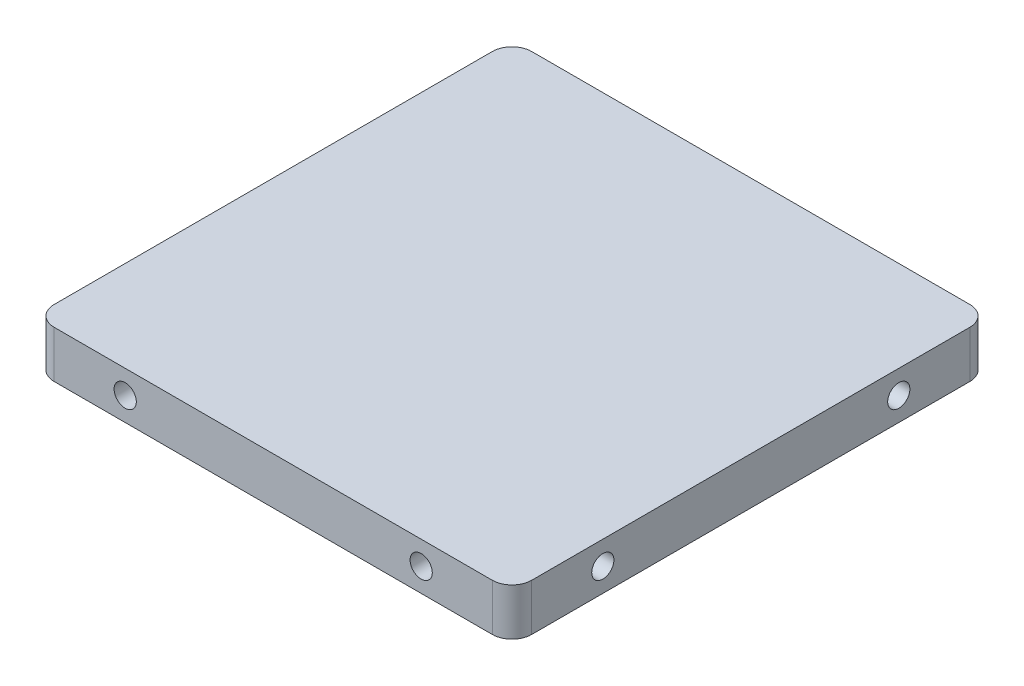
ISO-10303-21;
HEADER;
FILE_DESCRIPTION(('STEP AP214'),'2;1');
FILE_NAME('part.step','',(''),(''),'','','');
FILE_SCHEMA(('AUTOMOTIVE_DESIGN { 1 0 10303 214 1 1 1 1 }'));
ENDSEC;
DATA;
#1=APPLICATION_CONTEXT('core data for automotive mechanical design processes');
#2=APPLICATION_PROTOCOL_DEFINITION('international standard','automotive_design',2000,#1);
#3=PRODUCT_CONTEXT('',#1,'mechanical');
#4=PRODUCT('Part','Part','',(#3));
#5=PRODUCT_RELATED_PRODUCT_CATEGORY('part','',(#4));
#6=PRODUCT_DEFINITION_FORMATION('','',#4);
#7=PRODUCT_DEFINITION_CONTEXT('part definition',#1,'design');
#8=PRODUCT_DEFINITION('design','',#6,#7);
#9=PRODUCT_DEFINITION_SHAPE('','',#8);
#10=(LENGTH_UNIT() NAMED_UNIT(*) SI_UNIT(.MILLI.,.METRE.));
#11=(NAMED_UNIT(*) PLANE_ANGLE_UNIT() SI_UNIT($,.RADIAN.));
#12=(NAMED_UNIT(*) SI_UNIT($,.STERADIAN.) SOLID_ANGLE_UNIT());
#13=UNCERTAINTY_MEASURE_WITH_UNIT(LENGTH_MEASURE(1.E-05),#10,'distance_accuracy_value','');
#14=(GEOMETRIC_REPRESENTATION_CONTEXT(3) GLOBAL_UNCERTAINTY_ASSIGNED_CONTEXT((#13)) GLOBAL_UNIT_ASSIGNED_CONTEXT((#10,
#11,#12)) REPRESENTATION_CONTEXT('',''));
#15=CARTESIAN_POINT('',(0.,0.,0.));
#16=DIRECTION('',(0.,0.,1.));
#17=DIRECTION('',(1.,0.,0.));
#18=AXIS2_PLACEMENT_3D('',#15,#16,#17);
#19=CARTESIAN_POINT('',(-48.4125,0.,-30.));
#20=DIRECTION('',(-1.,0.,0.));
#21=DIRECTION('',(0.,0.,1.));
#22=AXIS2_PLACEMENT_3D('',#19,#20,#21);
#23=CYLINDRICAL_SURFACE('',#22,2.24999999999998);
#24=CARTESIAN_POINT('',(-30.,0.,-30.));
#25=DIRECTION('',(-0.707106781186547,0.,0.707106781186547));
#26=DIRECTION('',(-0.707106781186547,0.,-0.707106781186547));
#27=AXIS2_PLACEMENT_3D('',#24,#25,#26);
#28=ELLIPSE('',#27,3.18198051533944,2.24999999999998);
#29=CARTESIAN_POINT('',(-30.,-2.24999999999998,-30.));
#30=VERTEX_POINT('',#29);
#31=CARTESIAN_POINT('',(-30.,2.24999999999998,-30.));
#32=VERTEX_POINT('',#31);
#33=EDGE_CURVE('E160',#30,#32,#28,.T.);
#34=ORIENTED_EDGE('',*,*,#33,.T.);
#35=CARTESIAN_POINT('',(-30.,0.,-30.));
#36=DIRECTION('',(-0.707106781186547,0.,-0.707106781186547));
#37=DIRECTION('',(-0.707106781186547,0.,0.707106781186547));
#38=AXIS2_PLACEMENT_3D('',#35,#36,#37);
#39=ELLIPSE('',#38,3.18198051533944,2.24999999999998);
#40=EDGE_CURVE('E156',#32,#30,#39,.T.);
#41=ORIENTED_EDGE('',*,*,#40,.T.);
#42=EDGE_LOOP('',(#34,#41));
#43=FACE_BOUND('',#42,.T.);
#44=CARTESIAN_POINT('',(30.,0.,-30.));
#45=DIRECTION('',(-0.707106781186547,0.,0.707106781186547));
#46=DIRECTION('',(-0.707106781186547,0.,-0.707106781186547));
#47=AXIS2_PLACEMENT_3D('',#44,#45,#46);
#48=ELLIPSE('',#47,3.18198051533944,2.24999999999998);
#49=CARTESIAN_POINT('',(30.,-2.24999999999998,-30.));
#50=VERTEX_POINT('',#49);
#51=CARTESIAN_POINT('',(30.,2.24999999999998,-30.));
#52=VERTEX_POINT('',#51);
#53=EDGE_CURVE('E60',#50,#52,#48,.F.);
#54=ORIENTED_EDGE('',*,*,#53,.T.);
#55=CARTESIAN_POINT('',(30.,0.,-30.));
#56=DIRECTION('',(-0.707106781186547,0.,-0.707106781186547));
#57=DIRECTION('',(-0.707106781186547,0.,0.707106781186547));
#58=AXIS2_PLACEMENT_3D('',#55,#56,#57);
#59=ELLIPSE('',#58,3.18198051533944,2.24999999999998);
#60=EDGE_CURVE('E290',#52,#50,#59,.F.);
#61=ORIENTED_EDGE('',*,*,#60,.T.);
#62=EDGE_LOOP('',(#54,#61));
#63=FACE_BOUND('',#62,.T.);
#64=ADVANCED_FACE('F45',(#43,#63),#23,.F.);
#65=CARTESIAN_POINT('',(-48.4125,0.,30.));
#66=DIRECTION('',(-1.,0.,0.));
#67=DIRECTION('',(0.,0.,1.));
#68=AXIS2_PLACEMENT_3D('',#65,#66,#67);
#69=CYLINDRICAL_SURFACE('',#68,2.24999999999998);
#70=CARTESIAN_POINT('',(-30.,0.,30.));
#71=DIRECTION('',(-0.707106781186547,0.,0.707106781186547));
#72=DIRECTION('',(-0.707106781186547,0.,-0.707106781186547));
#73=AXIS2_PLACEMENT_3D('',#70,#71,#72);
#74=ELLIPSE('',#73,3.18198051533944,2.24999999999998);
#75=CARTESIAN_POINT('',(-30.,-2.24999999999998,30.));
#76=VERTEX_POINT('',#75);
#77=CARTESIAN_POINT('',(-30.,2.24999999999998,30.));
#78=VERTEX_POINT('',#77);
#79=EDGE_CURVE('E275',#76,#78,#74,.T.);
#80=ORIENTED_EDGE('',*,*,#79,.T.);
#81=CARTESIAN_POINT('',(-30.,0.,30.));
#82=DIRECTION('',(-0.707106781186547,0.,-0.707106781186547));
#83=DIRECTION('',(-0.707106781186547,0.,0.707106781186547));
#84=AXIS2_PLACEMENT_3D('',#81,#82,#83);
#85=ELLIPSE('',#84,3.18198051533944,2.24999999999998);
#86=EDGE_CURVE('E271',#78,#76,#85,.T.);
#87=ORIENTED_EDGE('',*,*,#86,.T.);
#88=EDGE_LOOP('',(#80,#87));
#89=FACE_BOUND('',#88,.T.);
#90=CARTESIAN_POINT('',(30.,0.,30.));
#91=DIRECTION('',(-0.707106781186547,0.,0.707106781186547));
#92=DIRECTION('',(-0.707106781186547,0.,-0.707106781186547));
#93=AXIS2_PLACEMENT_3D('',#90,#91,#92);
#94=ELLIPSE('',#93,3.18198051533944,2.24999999999998);
#95=CARTESIAN_POINT('',(30.,-2.24999999999998,30.));
#96=VERTEX_POINT('',#95);
#97=CARTESIAN_POINT('',(30.,2.24999999999998,30.));
#98=VERTEX_POINT('',#97);
#99=EDGE_CURVE('E66',#96,#98,#94,.F.);
#100=ORIENTED_EDGE('',*,*,#99,.T.);
#101=CARTESIAN_POINT('',(30.,0.,30.));
#102=DIRECTION('',(-0.707106781186547,0.,-0.707106781186547));
#103=DIRECTION('',(-0.707106781186547,0.,0.707106781186547));
#104=AXIS2_PLACEMENT_3D('',#101,#102,#103);
#105=ELLIPSE('',#104,3.18198051533944,2.24999999999998);
#106=EDGE_CURVE('E11',#98,#96,#105,.F.);
#107=ORIENTED_EDGE('',*,*,#106,.T.);
#108=EDGE_LOOP('',(#100,#107));
#109=FACE_BOUND('',#108,.T.);
#110=ADVANCED_FACE('F148',(#89,#109),#69,.F.);
#111=CARTESIAN_POINT('',(-48.4125,0.,30.));
#112=DIRECTION('',(-1.,0.,0.));
#113=DIRECTION('',(0.,0.,1.));
#114=AXIS2_PLACEMENT_3D('',#111,#112,#113);
#115=CIRCLE('',#114,2.24999999999999);
#116=CARTESIAN_POINT('',(-48.4125,0.,32.25));
#117=VERTEX_POINT('',#116);
#118=EDGE_CURVE('E255',#117,#117,#115,.T.);
#119=ORIENTED_EDGE('',*,*,#118,.T.);
#120=EDGE_LOOP('',(#119));
#121=FACE_BOUND('',#120,.T.);
#122=CARTESIAN_POINT('',(-30.,0.,30.));
#123=DIRECTION('',(-0.707106781186547,0.,0.707106781186547));
#124=DIRECTION('',(-0.707106781186547,0.,-0.707106781186547));
#125=AXIS2_PLACEMENT_3D('',#122,#123,#124);
#126=ELLIPSE('',#125,3.18198051533944,2.24999999999998);
#127=EDGE_CURVE('E279',#76,#78,#126,.F.);
#128=ORIENTED_EDGE('',*,*,#127,.T.);
#129=CARTESIAN_POINT('',(-30.,0.,30.));
#130=DIRECTION('',(-0.707106781186547,0.,-0.707106781186547));
#131=DIRECTION('',(-0.707106781186547,0.,0.707106781186547));
#132=AXIS2_PLACEMENT_3D('',#129,#130,#131);
#133=ELLIPSE('',#132,3.18198051533944,2.24999999999998);
#134=EDGE_CURVE('E267',#78,#76,#133,.F.);
#135=ORIENTED_EDGE('',*,*,#134,.T.);
#136=EDGE_LOOP('',(#128,#135));
#137=FACE_BOUND('',#136,.T.);
#138=ADVANCED_FACE('F375',(#121,#137),#69,.F.);
#139=CARTESIAN_POINT('',(-48.4125,0.,-30.));
#140=DIRECTION('',(-1.,0.,0.));
#141=DIRECTION('',(0.,0.,1.));
#142=AXIS2_PLACEMENT_3D('',#139,#140,#141);
#143=CIRCLE('',#142,2.24999999999999);
#144=CARTESIAN_POINT('',(-48.4125,0.,-27.75));
#145=VERTEX_POINT('',#144);
#146=EDGE_CURVE('E263',#145,#145,#143,.T.);
#147=ORIENTED_EDGE('',*,*,#146,.T.);
#148=EDGE_LOOP('',(#147));
#149=FACE_BOUND('',#148,.T.);
#150=CARTESIAN_POINT('',(-30.,0.,-30.));
#151=DIRECTION('',(-0.707106781186547,0.,0.707106781186547));
#152=DIRECTION('',(-0.707106781186547,0.,-0.707106781186547));
#153=AXIS2_PLACEMENT_3D('',#150,#151,#152);
#154=ELLIPSE('',#153,3.18198051533944,2.24999999999998);
#155=EDGE_CURVE('E164',#30,#32,#154,.F.);
#156=ORIENTED_EDGE('',*,*,#155,.T.);
#157=CARTESIAN_POINT('',(-30.,0.,-30.));
#158=DIRECTION('',(-0.707106781186547,0.,-0.707106781186547));
#159=DIRECTION('',(-0.707106781186547,0.,0.707106781186547));
#160=AXIS2_PLACEMENT_3D('',#157,#158,#159);
#161=ELLIPSE('',#160,3.18198051533944,2.24999999999998);
#162=EDGE_CURVE('E146',#32,#30,#161,.F.);
#163=ORIENTED_EDGE('',*,*,#162,.T.);
#164=EDGE_LOOP('',(#156,#163));
#165=FACE_BOUND('',#164,.T.);
#166=ADVANCED_FACE('F369',(#149,#165),#23,.F.);
#167=CARTESIAN_POINT('',(-48.4125,4.7625,48.4125));
#168=DIRECTION('',(1.,0.,0.));
#169=DIRECTION('',(0.,0.,-1.));
#170=AXIS2_PLACEMENT_3D('',#167,#168,#169);
#171=PLANE('',#170);
#172=ORIENTED_EDGE('',*,*,#146,.F.);
#173=EDGE_LOOP('',(#172));
#174=FACE_BOUND('',#173,.T.);
#175=ORIENTED_EDGE('',*,*,#118,.F.);
#176=EDGE_LOOP('',(#175));
#177=FACE_BOUND('',#176,.T.);
#178=DIRECTION('',(0.,0.,1.));
#179=VECTOR('',#178,1.);
#180=CARTESIAN_POINT('',(-48.4125,4.7625,48.4125));
#181=LINE('',#180,#179);
#182=CARTESIAN_POINT('',(-48.4125,4.7625,-44.4125));
#183=VERTEX_POINT('',#182);
#184=CARTESIAN_POINT('',(-48.4125,4.7625,44.4125));
#185=VERTEX_POINT('',#184);
#186=EDGE_CURVE('E224',#183,#185,#181,.T.);
#187=ORIENTED_EDGE('',*,*,#186,.F.);
#188=DIRECTION('',(0.,-1.,0.));
#189=VECTOR('',#188,1.);
#190=CARTESIAN_POINT('',(-48.4125,4.7625,-44.4125));
#191=LINE('',#190,#189);
#192=CARTESIAN_POINT('',(-48.4125,-4.7625,-44.4125));
#193=VERTEX_POINT('',#192);
#194=EDGE_CURVE('E212',#183,#193,#191,.T.);
#195=ORIENTED_EDGE('',*,*,#194,.T.);
#196=DIRECTION('',(0.,0.,1.));
#197=VECTOR('',#196,1.);
#198=CARTESIAN_POINT('',(-48.4125,-4.7625,48.4125));
#199=LINE('',#198,#197);
#200=CARTESIAN_POINT('',(-48.4125,-4.7625,44.4125));
#201=VERTEX_POINT('',#200);
#202=EDGE_CURVE('E233',#193,#201,#199,.T.);
#203=ORIENTED_EDGE('',*,*,#202,.T.);
#204=DIRECTION('',(0.,-1.,0.));
#205=VECTOR('',#204,1.);
#206=CARTESIAN_POINT('',(-48.4125,4.7625,44.4125));
#207=LINE('',#206,#205);
#208=EDGE_CURVE('E216',#201,#185,#207,.F.);
#209=ORIENTED_EDGE('',*,*,#208,.T.);
#210=EDGE_LOOP('',(#187,#195,#203,#209));
#211=FACE_BOUND('',#210,.T.);
#212=ADVANCED_FACE('F336',(#174,#177,#211),#171,.F.);
#213=CARTESIAN_POINT('',(48.4125,4.7625,48.4125));
#214=DIRECTION('',(0.,0.,-1.));
#215=DIRECTION('',(-1.,0.,0.));
#216=AXIS2_PLACEMENT_3D('',#213,#214,#215);
#217=PLANE('',#216);
#218=CARTESIAN_POINT('',(30.,0.,48.4125));
#219=DIRECTION('',(0.,0.,-1.));
#220=DIRECTION('',(-1.,0.,0.));
#221=AXIS2_PLACEMENT_3D('',#218,#219,#220);
#222=CIRCLE('',#221,2.24999999999997);
#223=CARTESIAN_POINT('',(27.75,0.,48.4125));
#224=VERTEX_POINT('',#223);
#225=EDGE_CURVE('E303',#224,#224,#222,.T.);
#226=ORIENTED_EDGE('',*,*,#225,.T.);
#227=EDGE_LOOP('',(#226));
#228=FACE_BOUND('',#227,.T.);
#229=CARTESIAN_POINT('',(-30.,0.,48.4125));
#230=DIRECTION('',(0.,0.,-1.));
#231=DIRECTION('',(-1.,0.,0.));
#232=AXIS2_PLACEMENT_3D('',#229,#230,#231);
#233=CIRCLE('',#232,2.24999999999997);
#234=CARTESIAN_POINT('',(-32.25,0.,48.4125));
#235=VERTEX_POINT('',#234);
#236=EDGE_CURVE('E282',#235,#235,#233,.T.);
#237=ORIENTED_EDGE('',*,*,#236,.T.);
#238=EDGE_LOOP('',(#237));
#239=FACE_BOUND('',#238,.T.);
#240=DIRECTION('',(1.,0.,0.));
#241=VECTOR('',#240,1.);
#242=CARTESIAN_POINT('',(48.4125,-4.7625,48.4125));
#243=LINE('',#242,#241);
#244=CARTESIAN_POINT('',(-44.4125,-4.7625,48.4125));
#245=VERTEX_POINT('',#244);
#246=CARTESIAN_POINT('',(44.4125,-4.7625,48.4125));
#247=VERTEX_POINT('',#246);
#248=EDGE_CURVE('E229',#245,#247,#243,.T.);
#249=ORIENTED_EDGE('',*,*,#248,.T.);
#250=DIRECTION('',(0.,-1.,0.));
#251=VECTOR('',#250,1.);
#252=CARTESIAN_POINT('',(44.4125,4.7625,48.4125));
#253=LINE('',#252,#251);
#254=CARTESIAN_POINT('',(44.4125,4.7625,48.4125));
#255=VERTEX_POINT('',#254);
#256=EDGE_CURVE('E167',#247,#255,#253,.F.);
#257=ORIENTED_EDGE('',*,*,#256,.T.);
#258=DIRECTION('',(1.,0.,0.));
#259=VECTOR('',#258,1.);
#260=CARTESIAN_POINT('',(48.4125,4.7625,48.4125));
#261=LINE('',#260,#259);
#262=CARTESIAN_POINT('',(-44.4125,4.7625,48.4125));
#263=VERTEX_POINT('',#262);
#264=EDGE_CURVE('E245',#263,#255,#261,.T.);
#265=ORIENTED_EDGE('',*,*,#264,.F.);
#266=DIRECTION('',(0.,-1.,0.));
#267=VECTOR('',#266,1.);
#268=CARTESIAN_POINT('',(-44.4125,4.7625,48.4125));
#269=LINE('',#268,#267);
#270=EDGE_CURVE('E170',#263,#245,#269,.T.);
#271=ORIENTED_EDGE('',*,*,#270,.T.);
#272=EDGE_LOOP('',(#249,#257,#265,#271));
#273=FACE_BOUND('',#272,.T.);
#274=ADVANCED_FACE('F344',(#228,#239,#273),#217,.F.);
#275=CARTESIAN_POINT('',(48.4125,4.7625,48.4125));
#276=DIRECTION('',(-1.,0.,0.));
#277=DIRECTION('',(0.,0.,1.));
#278=AXIS2_PLACEMENT_3D('',#275,#276,#277);
#279=PLANE('',#278);
#280=CARTESIAN_POINT('',(48.4125,0.,-30.));
#281=DIRECTION('',(-1.,0.,0.));
#282=DIRECTION('',(0.,0.,1.));
#283=AXIS2_PLACEMENT_3D('',#280,#281,#282);
#284=CIRCLE('',#283,2.24999999999998);
#285=CARTESIAN_POINT('',(48.4125,0.,-27.75));
#286=VERTEX_POINT('',#285);
#287=EDGE_CURVE('E259',#286,#286,#284,.T.);
#288=ORIENTED_EDGE('',*,*,#287,.T.);
#289=EDGE_LOOP('',(#288));
#290=FACE_BOUND('',#289,.T.);
#291=CARTESIAN_POINT('',(48.4125,0.,30.));
#292=DIRECTION('',(-1.,0.,0.));
#293=DIRECTION('',(0.,0.,1.));
#294=AXIS2_PLACEMENT_3D('',#291,#292,#293);
#295=CIRCLE('',#294,2.24999999999998);
#296=CARTESIAN_POINT('',(48.4125,0.,32.25));
#297=VERTEX_POINT('',#296);
#298=EDGE_CURVE('E237',#297,#297,#295,.T.);
#299=ORIENTED_EDGE('',*,*,#298,.T.);
#300=EDGE_LOOP('',(#299));
#301=FACE_BOUND('',#300,.T.);
#302=DIRECTION('',(0.,0.,-1.));
#303=VECTOR('',#302,1.);
#304=CARTESIAN_POINT('',(48.4125,-4.7625,48.4125));
#305=LINE('',#304,#303);
#306=CARTESIAN_POINT('',(48.4125,-4.7625,44.4125));
#307=VERTEX_POINT('',#306);
#308=CARTESIAN_POINT('',(48.4125,-4.7625,-44.4125));
#309=VERTEX_POINT('',#308);
#310=EDGE_CURVE('E225',#307,#309,#305,.T.);
#311=ORIENTED_EDGE('',*,*,#310,.T.);
#312=DIRECTION('',(0.,-1.,0.));
#313=VECTOR('',#312,1.);
#314=CARTESIAN_POINT('',(48.4125,4.7625,-44.4125));
#315=LINE('',#314,#313);
#316=CARTESIAN_POINT('',(48.4125,4.7625,-44.4125));
#317=VERTEX_POINT('',#316);
#318=EDGE_CURVE('E174',#309,#317,#315,.F.);
#319=ORIENTED_EDGE('',*,*,#318,.T.);
#320=DIRECTION('',(0.,0.,-1.));
#321=VECTOR('',#320,1.);
#322=CARTESIAN_POINT('',(48.4125,4.7625,48.4125));
#323=LINE('',#322,#321);
#324=CARTESIAN_POINT('',(48.4125,4.7625,44.4125));
#325=VERTEX_POINT('',#324);
#326=EDGE_CURVE('E241',#325,#317,#323,.T.);
#327=ORIENTED_EDGE('',*,*,#326,.F.);
#328=DIRECTION('',(0.,-1.,0.));
#329=VECTOR('',#328,1.);
#330=CARTESIAN_POINT('',(48.4125,4.7625,44.4125));
#331=LINE('',#330,#329);
#332=EDGE_CURVE('E177',#325,#307,#331,.T.);
#333=ORIENTED_EDGE('',*,*,#332,.T.);
#334=EDGE_LOOP('',(#311,#319,#327,#333));
#335=FACE_BOUND('',#334,.T.);
#336=ADVANCED_FACE('F319',(#290,#301,#335),#279,.F.);
#337=CARTESIAN_POINT('',(48.4125,4.7625,-48.4125));
#338=DIRECTION('',(0.,0.,1.));
#339=DIRECTION('',(1.,0.,0.));
#340=AXIS2_PLACEMENT_3D('',#337,#338,#339);
#341=PLANE('',#340);
#342=CARTESIAN_POINT('',(30.,0.,-48.4125));
#343=DIRECTION('',(0.,0.,-1.));
#344=DIRECTION('',(-1.,0.,0.));
#345=AXIS2_PLACEMENT_3D('',#342,#343,#344);
#346=CIRCLE('',#345,2.24999999999999);
#347=CARTESIAN_POINT('',(27.75,0.,-48.4125));
#348=VERTEX_POINT('',#347);
#349=EDGE_CURVE('E307',#348,#348,#346,.T.);
#350=ORIENTED_EDGE('',*,*,#349,.F.);
#351=EDGE_LOOP('',(#350));
#352=FACE_BOUND('',#351,.T.);
#353=CARTESIAN_POINT('',(-30.,0.,-48.4125));
#354=DIRECTION('',(0.,0.,-1.));
#355=DIRECTION('',(-1.,0.,0.));
#356=AXIS2_PLACEMENT_3D('',#353,#354,#355);
#357=CIRCLE('',#356,2.24999999999999);
#358=CARTESIAN_POINT('',(-32.25,0.,-48.4125));
#359=VERTEX_POINT('',#358);
#360=EDGE_CURVE('E286',#359,#359,#357,.T.);
#361=ORIENTED_EDGE('',*,*,#360,.F.);
#362=EDGE_LOOP('',(#361));
#363=FACE_BOUND('',#362,.T.);
#364=DIRECTION('',(-1.,0.,0.));
#365=VECTOR('',#364,1.);
#366=CARTESIAN_POINT('',(48.4125,-4.7625,-48.4125));
#367=LINE('',#366,#365);
#368=CARTESIAN_POINT('',(44.4125,-4.7625,-48.4125));
#369=VERTEX_POINT('',#368);
#370=CARTESIAN_POINT('',(-44.4125,-4.7625,-48.4125));
#371=VERTEX_POINT('',#370);
#372=EDGE_CURVE('E220',#369,#371,#367,.T.);
#373=ORIENTED_EDGE('',*,*,#372,.T.);
#374=DIRECTION('',(0.,-1.,0.));
#375=VECTOR('',#374,1.);
#376=CARTESIAN_POINT('',(-44.4125,4.7625,-48.4125));
#377=LINE('',#376,#375);
#378=CARTESIAN_POINT('',(-44.4125,4.7625,-48.4125));
#379=VERTEX_POINT('',#378);
#380=EDGE_CURVE('E193',#371,#379,#377,.F.);
#381=ORIENTED_EDGE('',*,*,#380,.T.);
#382=DIRECTION('',(-1.,0.,0.));
#383=VECTOR('',#382,1.);
#384=CARTESIAN_POINT('',(48.4125,4.7625,-48.4125));
#385=LINE('',#384,#383);
#386=CARTESIAN_POINT('',(44.4125,4.7625,-48.4125));
#387=VERTEX_POINT('',#386);
#388=EDGE_CURVE('E219',#387,#379,#385,.T.);
#389=ORIENTED_EDGE('',*,*,#388,.F.);
#390=DIRECTION('',(0.,-1.,0.));
#391=VECTOR('',#390,1.);
#392=CARTESIAN_POINT('',(44.4125,4.7625,-48.4125));
#393=LINE('',#392,#391);
#394=EDGE_CURVE('E196',#387,#369,#393,.T.);
#395=ORIENTED_EDGE('',*,*,#394,.T.);
#396=EDGE_LOOP('',(#373,#381,#389,#395));
#397=FACE_BOUND('',#396,.T.);
#398=ADVANCED_FACE('F315',(#352,#363,#397),#341,.F.);
#399=CARTESIAN_POINT('',(0.,4.7625,0.));
#400=DIRECTION('',(0.,1.,0.));
#401=DIRECTION('',(0.,0.,1.));
#402=AXIS2_PLACEMENT_3D('',#399,#400,#401);
#403=PLANE('',#402);
#404=ORIENTED_EDGE('',*,*,#388,.T.);
#405=CARTESIAN_POINT('',(-44.4125,4.7625,-44.4125));
#406=DIRECTION('',(0.,1.,0.));
#407=DIRECTION('',(0.,0.,1.));
#408=AXIS2_PLACEMENT_3D('',#405,#406,#407);
#409=CIRCLE('',#408,4.);
#410=EDGE_CURVE('E181',#379,#183,#409,.T.);
#411=ORIENTED_EDGE('',*,*,#410,.T.);
#412=ORIENTED_EDGE('',*,*,#186,.T.);
#413=CARTESIAN_POINT('',(-44.4125,4.7625,44.4125));
#414=DIRECTION('',(0.,1.,0.));
#415=DIRECTION('',(0.,0.,1.));
#416=AXIS2_PLACEMENT_3D('',#413,#414,#415);
#417=CIRCLE('',#416,4.);
#418=EDGE_CURVE('E190',#185,#263,#417,.T.);
#419=ORIENTED_EDGE('',*,*,#418,.T.);
#420=ORIENTED_EDGE('',*,*,#264,.T.);
#421=CARTESIAN_POINT('',(44.4125,4.7625,44.4125));
#422=DIRECTION('',(0.,1.,0.));
#423=DIRECTION('',(0.,0.,1.));
#424=AXIS2_PLACEMENT_3D('',#421,#422,#423);
#425=CIRCLE('',#424,4.);
#426=EDGE_CURVE('E187',#255,#325,#425,.T.);
#427=ORIENTED_EDGE('',*,*,#426,.T.);
#428=ORIENTED_EDGE('',*,*,#326,.T.);
#429=CARTESIAN_POINT('',(44.4125,4.7625,-44.4125));
#430=DIRECTION('',(0.,1.,0.));
#431=DIRECTION('',(0.,0.,1.));
#432=AXIS2_PLACEMENT_3D('',#429,#430,#431);
#433=CIRCLE('',#432,4.);
#434=EDGE_CURVE('E184',#317,#387,#433,.T.);
#435=ORIENTED_EDGE('',*,*,#434,.T.);
#436=EDGE_LOOP('',(#404,#411,#412,#419,#420,#427,#428,#435));
#437=FACE_BOUND('',#436,.T.);
#438=ADVANCED_FACE('F318',(#437),#403,.T.);
#439=CARTESIAN_POINT('',(0.,-4.7625,0.));
#440=DIRECTION('',(0.,1.,0.));
#441=DIRECTION('',(0.,0.,1.));
#442=AXIS2_PLACEMENT_3D('',#439,#440,#441);
#443=PLANE('',#442);
#444=ORIENTED_EDGE('',*,*,#202,.F.);
#445=CARTESIAN_POINT('',(-44.4125,-4.7625,-44.4125));
#446=DIRECTION('',(0.,1.,0.));
#447=DIRECTION('',(0.,0.,1.));
#448=AXIS2_PLACEMENT_3D('',#445,#446,#447);
#449=CIRCLE('',#448,4.);
#450=EDGE_CURVE('E200',#193,#371,#449,.F.);
#451=ORIENTED_EDGE('',*,*,#450,.T.);
#452=ORIENTED_EDGE('',*,*,#372,.F.);
#453=CARTESIAN_POINT('',(44.4125,-4.7625,-44.4125));
#454=DIRECTION('',(0.,1.,0.));
#455=DIRECTION('',(0.,0.,1.));
#456=AXIS2_PLACEMENT_3D('',#453,#454,#455);
#457=CIRCLE('',#456,4.);
#458=EDGE_CURVE('E203',#369,#309,#457,.F.);
#459=ORIENTED_EDGE('',*,*,#458,.T.);
#460=ORIENTED_EDGE('',*,*,#310,.F.);
#461=CARTESIAN_POINT('',(44.4125,-4.7625,44.4125));
#462=DIRECTION('',(0.,1.,0.));
#463=DIRECTION('',(0.,0.,1.));
#464=AXIS2_PLACEMENT_3D('',#461,#462,#463);
#465=CIRCLE('',#464,4.);
#466=EDGE_CURVE('E206',#307,#247,#465,.F.);
#467=ORIENTED_EDGE('',*,*,#466,.T.);
#468=ORIENTED_EDGE('',*,*,#248,.F.);
#469=CARTESIAN_POINT('',(-44.4125,-4.7625,44.4125));
#470=DIRECTION('',(0.,1.,0.));
#471=DIRECTION('',(0.,0.,1.));
#472=AXIS2_PLACEMENT_3D('',#469,#470,#471);
#473=CIRCLE('',#472,4.);
#474=EDGE_CURVE('E209',#245,#201,#473,.F.);
#475=ORIENTED_EDGE('',*,*,#474,.T.);
#476=EDGE_LOOP('',(#444,#451,#452,#459,#460,#467,#468,#475));
#477=FACE_BOUND('',#476,.T.);
#478=ADVANCED_FACE('F357',(#477),#443,.F.);
#479=CARTESIAN_POINT('',(-44.4125,4.7625,-44.4125));
#480=DIRECTION('',(0.,-1.,0.));
#481=DIRECTION('',(0.,0.,-1.));
#482=AXIS2_PLACEMENT_3D('',#479,#480,#481);
#483=CYLINDRICAL_SURFACE('',#482,4.);
#484=ORIENTED_EDGE('',*,*,#410,.F.);
#485=ORIENTED_EDGE('',*,*,#380,.F.);
#486=ORIENTED_EDGE('',*,*,#450,.F.);
#487=ORIENTED_EDGE('',*,*,#194,.F.);
#488=EDGE_LOOP('',(#484,#485,#486,#487));
#489=FACE_BOUND('',#488,.T.);
#490=ADVANCED_FACE('F330',(#489),#483,.T.);
#491=CARTESIAN_POINT('',(44.4125,4.7625,-44.4125));
#492=DIRECTION('',(0.,-1.,0.));
#493=DIRECTION('',(0.,0.,-1.));
#494=AXIS2_PLACEMENT_3D('',#491,#492,#493);
#495=CYLINDRICAL_SURFACE('',#494,4.);
#496=ORIENTED_EDGE('',*,*,#434,.F.);
#497=ORIENTED_EDGE('',*,*,#318,.F.);
#498=ORIENTED_EDGE('',*,*,#458,.F.);
#499=ORIENTED_EDGE('',*,*,#394,.F.);
#500=EDGE_LOOP('',(#496,#497,#498,#499));
#501=FACE_BOUND('',#500,.T.);
#502=ADVANCED_FACE('F356',(#501),#495,.T.);
#503=CARTESIAN_POINT('',(44.4125,4.7625,44.4125));
#504=DIRECTION('',(0.,-1.,0.));
#505=DIRECTION('',(0.,0.,-1.));
#506=AXIS2_PLACEMENT_3D('',#503,#504,#505);
#507=CYLINDRICAL_SURFACE('',#506,4.);
#508=ORIENTED_EDGE('',*,*,#426,.F.);
#509=ORIENTED_EDGE('',*,*,#256,.F.);
#510=ORIENTED_EDGE('',*,*,#466,.F.);
#511=ORIENTED_EDGE('',*,*,#332,.F.);
#512=EDGE_LOOP('',(#508,#509,#510,#511));
#513=FACE_BOUND('',#512,.T.);
#514=ADVANCED_FACE('F348',(#513),#507,.T.);
#515=CARTESIAN_POINT('',(-44.4125,4.7625,44.4125));
#516=DIRECTION('',(0.,-1.,0.));
#517=DIRECTION('',(0.,0.,-1.));
#518=AXIS2_PLACEMENT_3D('',#515,#516,#517);
#519=CYLINDRICAL_SURFACE('',#518,4.);
#520=ORIENTED_EDGE('',*,*,#418,.F.);
#521=ORIENTED_EDGE('',*,*,#208,.F.);
#522=ORIENTED_EDGE('',*,*,#474,.F.);
#523=ORIENTED_EDGE('',*,*,#270,.F.);
#524=EDGE_LOOP('',(#520,#521,#522,#523));
#525=FACE_BOUND('',#524,.T.);
#526=ADVANCED_FACE('F47',(#525),#519,.T.);
#527=CARTESIAN_POINT('',(30.,0.,30.));
#528=DIRECTION('',(-0.707106781186547,0.,0.707106781186547));
#529=DIRECTION('',(-0.707106781186547,0.,-0.707106781186547));
#530=AXIS2_PLACEMENT_3D('',#527,#528,#529);
#531=ELLIPSE('',#530,3.18198051533944,2.24999999999998);
#532=EDGE_CURVE('E136',#96,#98,#531,.T.);
#533=ORIENTED_EDGE('',*,*,#532,.T.);
#534=CARTESIAN_POINT('',(30.,0.,30.));
#535=DIRECTION('',(-0.707106781186547,0.,-0.707106781186547));
#536=DIRECTION('',(-0.707106781186547,0.,0.707106781186547));
#537=AXIS2_PLACEMENT_3D('',#534,#535,#536);
#538=ELLIPSE('',#537,3.18198051533944,2.24999999999998);
#539=EDGE_CURVE('E54',#98,#96,#538,.T.);
#540=ORIENTED_EDGE('',*,*,#539,.T.);
#541=EDGE_LOOP('',(#533,#540));
#542=FACE_BOUND('',#541,.T.);
#543=ORIENTED_EDGE('',*,*,#298,.F.);
#544=EDGE_LOOP('',(#543));
#545=FACE_BOUND('',#544,.T.);
#546=ADVANCED_FACE('F149',(#542,#545),#69,.F.);
#547=CARTESIAN_POINT('',(30.,0.,-30.));
#548=DIRECTION('',(-0.707106781186547,0.,0.707106781186547));
#549=DIRECTION('',(-0.707106781186547,0.,-0.707106781186547));
#550=AXIS2_PLACEMENT_3D('',#547,#548,#549);
#551=ELLIPSE('',#550,3.18198051533944,2.24999999999998);
#552=EDGE_CURVE('E297',#50,#52,#551,.T.);
#553=ORIENTED_EDGE('',*,*,#552,.T.);
#554=CARTESIAN_POINT('',(30.,0.,-30.));
#555=DIRECTION('',(-0.707106781186547,0.,-0.707106781186547));
#556=DIRECTION('',(-0.707106781186547,0.,0.707106781186547));
#557=AXIS2_PLACEMENT_3D('',#554,#555,#556);
#558=ELLIPSE('',#557,3.18198051533944,2.24999999999998);
#559=EDGE_CURVE('E293',#52,#50,#558,.T.);
#560=ORIENTED_EDGE('',*,*,#559,.T.);
#561=EDGE_LOOP('',(#553,#560));
#562=FACE_BOUND('',#561,.T.);
#563=ORIENTED_EDGE('',*,*,#287,.F.);
#564=EDGE_LOOP('',(#563));
#565=FACE_BOUND('',#564,.T.);
#566=ADVANCED_FACE('F370',(#562,#565),#23,.F.);
#567=CARTESIAN_POINT('',(-30.,0.,-48.4125));
#568=DIRECTION('',(0.,0.,-1.));
#569=DIRECTION('',(-1.,0.,0.));
#570=AXIS2_PLACEMENT_3D('',#567,#568,#569);
#571=CYLINDRICAL_SURFACE('',#570,2.24999999999998);
#572=ORIENTED_EDGE('',*,*,#360,.T.);
#573=EDGE_LOOP('',(#572));
#574=FACE_BOUND('',#573,.T.);
#575=ORIENTED_EDGE('',*,*,#155,.F.);
#576=ORIENTED_EDGE('',*,*,#40,.F.);
#577=EDGE_LOOP('',(#575,#576));
#578=FACE_BOUND('',#577,.T.);
#579=ADVANCED_FACE('F382',(#574,#578),#571,.F.);
#580=ORIENTED_EDGE('',*,*,#33,.F.);
#581=ORIENTED_EDGE('',*,*,#162,.F.);
#582=EDGE_LOOP('',(#580,#581));
#583=FACE_BOUND('',#582,.T.);
#584=ORIENTED_EDGE('',*,*,#127,.F.);
#585=ORIENTED_EDGE('',*,*,#86,.F.);
#586=EDGE_LOOP('',(#584,#585));
#587=FACE_BOUND('',#586,.T.);
#588=ADVANCED_FACE('F388',(#583,#587),#571,.F.);
#589=ORIENTED_EDGE('',*,*,#236,.F.);
#590=EDGE_LOOP('',(#589));
#591=FACE_BOUND('',#590,.T.);
#592=ORIENTED_EDGE('',*,*,#79,.F.);
#593=ORIENTED_EDGE('',*,*,#134,.F.);
#594=EDGE_LOOP('',(#592,#593));
#595=FACE_BOUND('',#594,.T.);
#596=ADVANCED_FACE('F390',(#591,#595),#571,.F.);
#597=CARTESIAN_POINT('',(30.,0.,-48.4125));
#598=DIRECTION('',(0.,0.,-1.));
#599=DIRECTION('',(-1.,0.,0.));
#600=AXIS2_PLACEMENT_3D('',#597,#598,#599);
#601=CYLINDRICAL_SURFACE('',#600,2.24999999999998);
#602=ORIENTED_EDGE('',*,*,#99,.F.);
#603=ORIENTED_EDGE('',*,*,#539,.F.);
#604=EDGE_LOOP('',(#602,#603));
#605=FACE_BOUND('',#604,.T.);
#606=ORIENTED_EDGE('',*,*,#552,.F.);
#607=ORIENTED_EDGE('',*,*,#60,.F.);
#608=EDGE_LOOP('',(#606,#607));
#609=FACE_BOUND('',#608,.T.);
#610=ADVANCED_FACE('F143',(#605,#609),#601,.F.);
#611=ORIENTED_EDGE('',*,*,#349,.T.);
#612=EDGE_LOOP('',(#611));
#613=FACE_BOUND('',#612,.T.);
#614=ORIENTED_EDGE('',*,*,#53,.F.);
#615=ORIENTED_EDGE('',*,*,#559,.F.);
#616=EDGE_LOOP('',(#614,#615));
#617=FACE_BOUND('',#616,.T.);
#618=ADVANCED_FACE('F312',(#613,#617),#601,.F.);
#619=ORIENTED_EDGE('',*,*,#225,.F.);
#620=EDGE_LOOP('',(#619));
#621=FACE_BOUND('',#620,.T.);
#622=ORIENTED_EDGE('',*,*,#532,.F.);
#623=ORIENTED_EDGE('',*,*,#106,.F.);
#624=EDGE_LOOP('',(#622,#623));
#625=FACE_BOUND('',#624,.T.);
#626=ADVANCED_FACE('F137',(#621,#625),#601,.F.);
#627=CLOSED_SHELL('',(#64,#110,#138,#166,#212,#274,#336,#398,#438,#478,#490,#502,#514,#526,#546,
#566,#579,#588,#596,#610,#618,#626));
#628=MANIFOLD_SOLID_BREP('B2',#627);
#629=ADVANCED_BREP_SHAPE_REPRESENTATION('',(#18,#628),#14);
#630=SHAPE_DEFINITION_REPRESENTATION(#9,#629);
ENDSEC;
END-ISO-10303-21;
